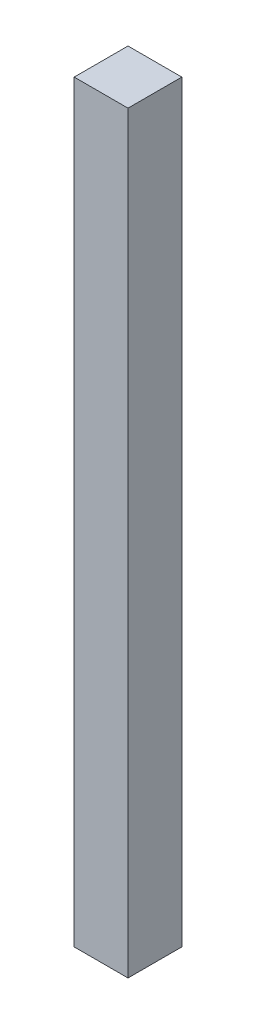
ISO-10303-21;
HEADER;
FILE_DESCRIPTION(('STEP AP214'),'2;1');
FILE_NAME('part.step','',(''),(''),'','','');
FILE_SCHEMA(('AUTOMOTIVE_DESIGN { 1 0 10303 214 1 1 1 1 }'));
ENDSEC;
DATA;
#1=APPLICATION_CONTEXT('core data for automotive mechanical design processes');
#2=APPLICATION_PROTOCOL_DEFINITION('international standard','automotive_design',2000,#1);
#3=PRODUCT_CONTEXT('',#1,'mechanical');
#4=PRODUCT('Part','Part','',(#3));
#5=PRODUCT_RELATED_PRODUCT_CATEGORY('part','',(#4));
#6=PRODUCT_DEFINITION_FORMATION('','',#4);
#7=PRODUCT_DEFINITION_CONTEXT('part definition',#1,'design');
#8=PRODUCT_DEFINITION('design','',#6,#7);
#9=PRODUCT_DEFINITION_SHAPE('','',#8);
#10=(LENGTH_UNIT() NAMED_UNIT(*) SI_UNIT(.MILLI.,.METRE.));
#11=(NAMED_UNIT(*) PLANE_ANGLE_UNIT() SI_UNIT($,.RADIAN.));
#12=(NAMED_UNIT(*) SI_UNIT($,.STERADIAN.) SOLID_ANGLE_UNIT());
#13=UNCERTAINTY_MEASURE_WITH_UNIT(LENGTH_MEASURE(1.E-05),#10,'distance_accuracy_value','');
#14=(GEOMETRIC_REPRESENTATION_CONTEXT(3) GLOBAL_UNCERTAINTY_ASSIGNED_CONTEXT((#13)) GLOBAL_UNIT_ASSIGNED_CONTEXT((#10,
#11,#12)) REPRESENTATION_CONTEXT('',''));
#15=CARTESIAN_POINT('',(0.,0.,0.));
#16=DIRECTION('',(0.,0.,1.));
#17=DIRECTION('',(1.,0.,0.));
#18=AXIS2_PLACEMENT_3D('',#15,#16,#17);
#19=CARTESIAN_POINT('',(0.,140.,0.));
#20=DIRECTION('',(1.,0.,0.));
#21=DIRECTION('',(0.,0.,-1.));
#22=AXIS2_PLACEMENT_3D('',#19,#20,#21);
#23=PLANE('',#22);
#24=DIRECTION('',(0.,0.,1.));
#25=VECTOR('',#24,1.);
#26=CARTESIAN_POINT('',(0.,0.,0.));
#27=LINE('',#26,#25);
#28=CARTESIAN_POINT('',(0.,0.,-10.));
#29=VERTEX_POINT('',#28);
#30=CARTESIAN_POINT('',(0.,0.,0.));
#31=VERTEX_POINT('',#30);
#32=EDGE_CURVE('E94',#29,#31,#27,.T.);
#33=ORIENTED_EDGE('',*,*,#32,.T.);
#34=DIRECTION('',(0.,-1.,0.));
#35=VECTOR('',#34,1.);
#36=CARTESIAN_POINT('',(0.,140.,0.));
#37=LINE('',#36,#35);
#38=CARTESIAN_POINT('',(0.,140.,0.));
#39=VERTEX_POINT('',#38);
#40=EDGE_CURVE('E11',#39,#31,#37,.T.);
#41=ORIENTED_EDGE('',*,*,#40,.F.);
#42=DIRECTION('',(0.,0.,1.));
#43=VECTOR('',#42,1.);
#44=CARTESIAN_POINT('',(0.,140.,0.));
#45=LINE('',#44,#43);
#46=CARTESIAN_POINT('',(0.,140.,-10.));
#47=VERTEX_POINT('',#46);
#48=EDGE_CURVE('E82',#47,#39,#45,.T.);
#49=ORIENTED_EDGE('',*,*,#48,.F.);
#50=DIRECTION('',(0.,-1.,0.));
#51=VECTOR('',#50,1.);
#52=CARTESIAN_POINT('',(0.,140.,-10.));
#53=LINE('',#52,#51);
#54=EDGE_CURVE('E90',#47,#29,#53,.T.);
#55=ORIENTED_EDGE('',*,*,#54,.T.);
#56=EDGE_LOOP('',(#33,#41,#49,#55));
#57=FACE_BOUND('',#56,.T.);
#58=ADVANCED_FACE('F31',(#57),#23,.F.);
#59=CARTESIAN_POINT('',(0.,140.,0.));
#60=DIRECTION('',(0.,0.,-1.));
#61=DIRECTION('',(-1.,0.,0.));
#62=AXIS2_PLACEMENT_3D('',#59,#60,#61);
#63=PLANE('',#62);
#64=DIRECTION('',(1.,0.,0.));
#65=VECTOR('',#64,1.);
#66=CARTESIAN_POINT('',(0.,0.,0.));
#67=LINE('',#66,#65);
#68=CARTESIAN_POINT('',(10.,0.,0.));
#69=VERTEX_POINT('',#68);
#70=EDGE_CURVE('E86',#31,#69,#67,.T.);
#71=ORIENTED_EDGE('',*,*,#70,.T.);
#72=DIRECTION('',(0.,-1.,0.));
#73=VECTOR('',#72,1.);
#74=CARTESIAN_POINT('',(10.,140.,0.));
#75=LINE('',#74,#73);
#76=CARTESIAN_POINT('',(10.,140.,0.));
#77=VERTEX_POINT('',#76);
#78=EDGE_CURVE('E39',#77,#69,#75,.T.);
#79=ORIENTED_EDGE('',*,*,#78,.F.);
#80=DIRECTION('',(1.,0.,0.));
#81=VECTOR('',#80,1.);
#82=CARTESIAN_POINT('',(0.,140.,0.));
#83=LINE('',#82,#81);
#84=EDGE_CURVE('E77',#39,#77,#83,.T.);
#85=ORIENTED_EDGE('',*,*,#84,.F.);
#86=ORIENTED_EDGE('',*,*,#40,.T.);
#87=EDGE_LOOP('',(#71,#79,#85,#86));
#88=FACE_BOUND('',#87,.T.);
#89=ADVANCED_FACE('F85',(#88),#63,.F.);
#90=CARTESIAN_POINT('',(10.,140.,0.));
#91=DIRECTION('',(-1.,0.,0.));
#92=DIRECTION('',(0.,0.,1.));
#93=AXIS2_PLACEMENT_3D('',#90,#91,#92);
#94=PLANE('',#93);
#95=DIRECTION('',(0.,0.,-1.));
#96=VECTOR('',#95,1.);
#97=CARTESIAN_POINT('',(10.,0.,0.));
#98=LINE('',#97,#96);
#99=CARTESIAN_POINT('',(10.,0.,-10.));
#100=VERTEX_POINT('',#99);
#101=EDGE_CURVE('E64',#69,#100,#98,.T.);
#102=ORIENTED_EDGE('',*,*,#101,.T.);
#103=DIRECTION('',(0.,-1.,0.));
#104=VECTOR('',#103,1.);
#105=CARTESIAN_POINT('',(10.,140.,-10.));
#106=LINE('',#105,#104);
#107=CARTESIAN_POINT('',(10.,140.,-10.));
#108=VERTEX_POINT('',#107);
#109=EDGE_CURVE('E87',#108,#100,#106,.T.);
#110=ORIENTED_EDGE('',*,*,#109,.F.);
#111=DIRECTION('',(0.,0.,-1.));
#112=VECTOR('',#111,1.);
#113=CARTESIAN_POINT('',(10.,140.,0.));
#114=LINE('',#113,#112);
#115=EDGE_CURVE('E80',#77,#108,#114,.T.);
#116=ORIENTED_EDGE('',*,*,#115,.F.);
#117=ORIENTED_EDGE('',*,*,#78,.T.);
#118=EDGE_LOOP('',(#102,#110,#116,#117));
#119=FACE_BOUND('',#118,.T.);
#120=ADVANCED_FACE('F88',(#119),#94,.F.);
#121=CARTESIAN_POINT('',(0.,140.,-10.));
#122=DIRECTION('',(0.,0.,1.));
#123=DIRECTION('',(1.,0.,0.));
#124=AXIS2_PLACEMENT_3D('',#121,#122,#123);
#125=PLANE('',#124);
#126=DIRECTION('',(-1.,0.,0.));
#127=VECTOR('',#126,1.);
#128=CARTESIAN_POINT('',(0.,0.,-10.));
#129=LINE('',#128,#127);
#130=EDGE_CURVE('E70',#100,#29,#129,.T.);
#131=ORIENTED_EDGE('',*,*,#130,.T.);
#132=ORIENTED_EDGE('',*,*,#54,.F.);
#133=DIRECTION('',(-1.,0.,0.));
#134=VECTOR('',#133,1.);
#135=CARTESIAN_POINT('',(0.,140.,-10.));
#136=LINE('',#135,#134);
#137=EDGE_CURVE('E47',#108,#47,#136,.T.);
#138=ORIENTED_EDGE('',*,*,#137,.F.);
#139=ORIENTED_EDGE('',*,*,#109,.T.);
#140=EDGE_LOOP('',(#131,#132,#138,#139));
#141=FACE_BOUND('',#140,.T.);
#142=ADVANCED_FACE('F101',(#141),#125,.F.);
#143=CARTESIAN_POINT('',(0.,140.,-10.));
#144=DIRECTION('',(0.,-1.,0.));
#145=DIRECTION('',(0.,0.,-1.));
#146=AXIS2_PLACEMENT_3D('',#143,#144,#145);
#147=PLANE('',#146);
#148=ORIENTED_EDGE('',*,*,#48,.T.);
#149=ORIENTED_EDGE('',*,*,#84,.T.);
#150=ORIENTED_EDGE('',*,*,#115,.T.);
#151=ORIENTED_EDGE('',*,*,#137,.T.);
#152=EDGE_LOOP('',(#148,#149,#150,#151));
#153=FACE_BOUND('',#152,.T.);
#154=ADVANCED_FACE('F78',(#153),#147,.F.);
#155=CARTESIAN_POINT('',(0.,0.,-10.));
#156=DIRECTION('',(0.,-1.,0.));
#157=DIRECTION('',(0.,0.,-1.));
#158=AXIS2_PLACEMENT_3D('',#155,#156,#157);
#159=PLANE('',#158);
#160=ORIENTED_EDGE('',*,*,#32,.F.);
#161=ORIENTED_EDGE('',*,*,#130,.F.);
#162=ORIENTED_EDGE('',*,*,#101,.F.);
#163=ORIENTED_EDGE('',*,*,#70,.F.);
#164=EDGE_LOOP('',(#160,#161,#162,#163));
#165=FACE_BOUND('',#164,.T.);
#166=ADVANCED_FACE('F104',(#165),#159,.T.);
#167=CLOSED_SHELL('',(#58,#89,#120,#142,#154,#166));
#168=MANIFOLD_SOLID_BREP('B2',#167);
#169=ADVANCED_BREP_SHAPE_REPRESENTATION('',(#18,#168),#14);
#170=SHAPE_DEFINITION_REPRESENTATION(#9,#169);
ENDSEC;
END-ISO-10303-21;
